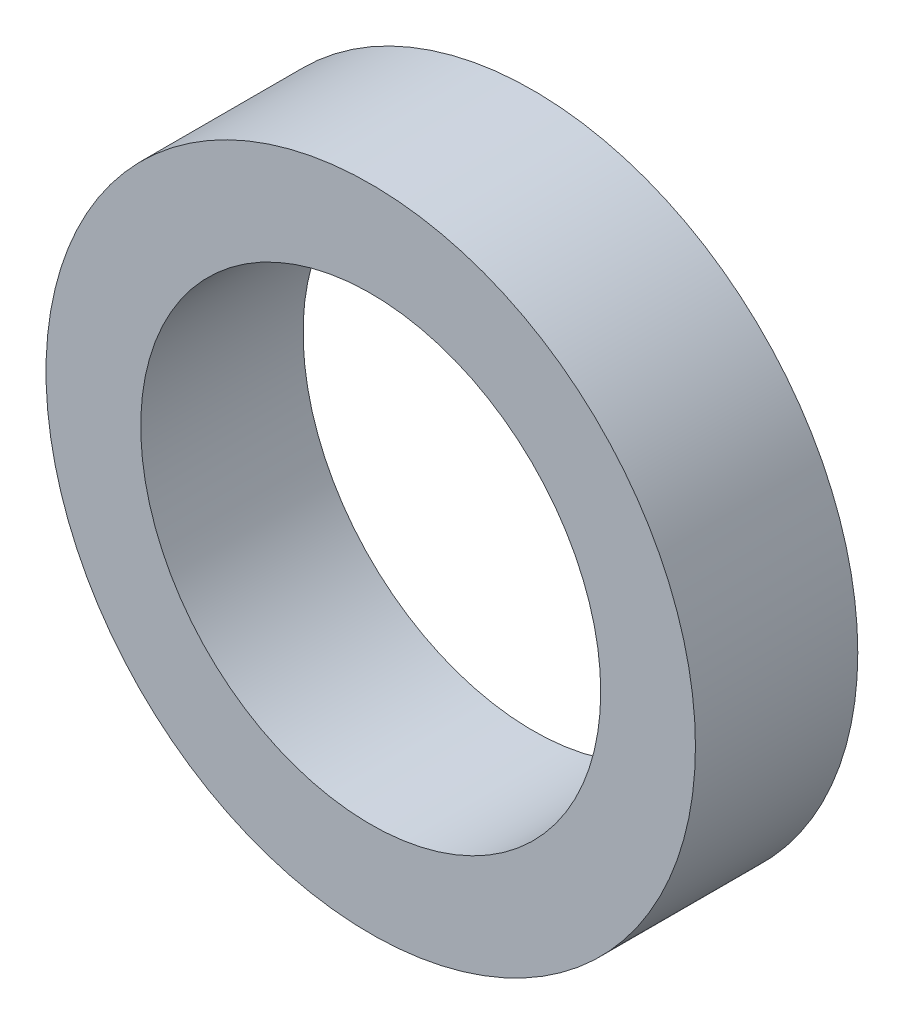
ISO-10303-21;
HEADER;
FILE_DESCRIPTION(('STEP AP214'),'2;1');
FILE_NAME('part.step','',(''),(''),'','','');
FILE_SCHEMA(('AUTOMOTIVE_DESIGN { 1 0 10303 214 1 1 1 1 }'));
ENDSEC;
DATA;
#1=APPLICATION_CONTEXT('core data for automotive mechanical design processes');
#2=APPLICATION_PROTOCOL_DEFINITION('international standard','automotive_design',2000,#1);
#3=PRODUCT_CONTEXT('',#1,'mechanical');
#4=PRODUCT('Part','Part','',(#3));
#5=PRODUCT_RELATED_PRODUCT_CATEGORY('part','',(#4));
#6=PRODUCT_DEFINITION_FORMATION('','',#4);
#7=PRODUCT_DEFINITION_CONTEXT('part definition',#1,'design');
#8=PRODUCT_DEFINITION('design','',#6,#7);
#9=PRODUCT_DEFINITION_SHAPE('','',#8);
#10=(LENGTH_UNIT() NAMED_UNIT(*) SI_UNIT(.MILLI.,.METRE.));
#11=(NAMED_UNIT(*) PLANE_ANGLE_UNIT() SI_UNIT($,.RADIAN.));
#12=(NAMED_UNIT(*) SI_UNIT($,.STERADIAN.) SOLID_ANGLE_UNIT());
#13=UNCERTAINTY_MEASURE_WITH_UNIT(LENGTH_MEASURE(1.E-05),#10,'distance_accuracy_value','');
#14=(GEOMETRIC_REPRESENTATION_CONTEXT(3) GLOBAL_UNCERTAINTY_ASSIGNED_CONTEXT((#13)) GLOBAL_UNIT_ASSIGNED_CONTEXT((#10,
#11,#12)) REPRESENTATION_CONTEXT('',''));
#15=CARTESIAN_POINT('',(0.,0.,0.));
#16=DIRECTION('',(0.,0.,1.));
#17=DIRECTION('',(1.,0.,0.));
#18=AXIS2_PLACEMENT_3D('',#15,#16,#17);
#19=CARTESIAN_POINT('',(0.,0.,3.));
#20=DIRECTION('',(0.,0.,1.));
#21=DIRECTION('',(1.,0.,0.));
#22=AXIS2_PLACEMENT_3D('',#19,#20,#21);
#23=PLANE('',#22);
#24=CARTESIAN_POINT('',(0.,0.,3.));
#25=DIRECTION('',(0.,0.,1.));
#26=DIRECTION('',(1.,0.,0.));
#27=AXIS2_PLACEMENT_3D('',#24,#25,#26);
#28=CIRCLE('',#27,6.);
#29=CARTESIAN_POINT('',(6.,0.,3.));
#30=VERTEX_POINT('',#29);
#31=EDGE_CURVE('E10',#30,#30,#28,.T.);
#32=ORIENTED_EDGE('',*,*,#31,.T.);
#33=EDGE_LOOP('',(#32));
#34=FACE_BOUND('',#33,.T.);
#35=CARTESIAN_POINT('',(0.,0.,3.));
#36=DIRECTION('',(0.,0.,1.));
#37=DIRECTION('',(1.,0.,0.));
#38=AXIS2_PLACEMENT_3D('',#35,#36,#37);
#39=CIRCLE('',#38,4.25);
#40=CARTESIAN_POINT('',(4.25,0.,3.));
#41=VERTEX_POINT('',#40);
#42=EDGE_CURVE('E42',#41,#41,#39,.T.);
#43=ORIENTED_EDGE('',*,*,#42,.F.);
#44=EDGE_LOOP('',(#43));
#45=FACE_BOUND('',#44,.T.);
#46=ADVANCED_FACE('F31',(#34,#45),#23,.T.);
#47=CARTESIAN_POINT('',(0.,0.,0.));
#48=DIRECTION('',(0.,0.,1.));
#49=DIRECTION('',(1.,0.,0.));
#50=AXIS2_PLACEMENT_3D('',#47,#48,#49);
#51=PLANE('',#50);
#52=CARTESIAN_POINT('',(0.,0.,0.));
#53=DIRECTION('',(0.,0.,1.));
#54=DIRECTION('',(1.,0.,0.));
#55=AXIS2_PLACEMENT_3D('',#52,#53,#54);
#56=CIRCLE('',#55,6.);
#57=CARTESIAN_POINT('',(6.,0.,0.));
#58=VERTEX_POINT('',#57);
#59=EDGE_CURVE('E35',#58,#58,#56,.T.);
#60=ORIENTED_EDGE('',*,*,#59,.F.);
#61=EDGE_LOOP('',(#60));
#62=FACE_BOUND('',#61,.T.);
#63=CARTESIAN_POINT('',(0.,0.,0.));
#64=DIRECTION('',(0.,0.,1.));
#65=DIRECTION('',(1.,0.,0.));
#66=AXIS2_PLACEMENT_3D('',#63,#64,#65);
#67=CIRCLE('',#66,4.25);
#68=CARTESIAN_POINT('',(4.25,0.,0.));
#69=VERTEX_POINT('',#68);
#70=EDGE_CURVE('E44',#69,#69,#67,.T.);
#71=ORIENTED_EDGE('',*,*,#70,.T.);
#72=EDGE_LOOP('',(#71));
#73=FACE_BOUND('',#72,.T.);
#74=ADVANCED_FACE('F54',(#62,#73),#51,.F.);
#75=CARTESIAN_POINT('',(0.,0.,3.));
#76=DIRECTION('',(0.,0.,-1.));
#77=DIRECTION('',(-1.,0.,0.));
#78=AXIS2_PLACEMENT_3D('',#75,#76,#77);
#79=CYLINDRICAL_SURFACE('',#78,6.);
#80=ORIENTED_EDGE('',*,*,#31,.F.);
#81=EDGE_LOOP('',(#80));
#82=FACE_BOUND('',#81,.T.);
#83=ORIENTED_EDGE('',*,*,#59,.T.);
#84=EDGE_LOOP('',(#83));
#85=FACE_BOUND('',#84,.T.);
#86=ADVANCED_FACE('F33',(#82,#85),#79,.T.);
#87=CARTESIAN_POINT('',(0.,0.,3.));
#88=DIRECTION('',(0.,0.,-1.));
#89=DIRECTION('',(-1.,0.,0.));
#90=AXIS2_PLACEMENT_3D('',#87,#88,#89);
#91=CYLINDRICAL_SURFACE('',#90,4.25);
#92=ORIENTED_EDGE('',*,*,#42,.T.);
#93=EDGE_LOOP('',(#92));
#94=FACE_BOUND('',#93,.T.);
#95=ORIENTED_EDGE('',*,*,#70,.F.);
#96=EDGE_LOOP('',(#95));
#97=FACE_BOUND('',#96,.T.);
#98=ADVANCED_FACE('F50',(#94,#97),#91,.F.);
#99=CLOSED_SHELL('',(#46,#74,#86,#98));
#100=MANIFOLD_SOLID_BREP('B2',#99);
#101=ADVANCED_BREP_SHAPE_REPRESENTATION('',(#18,#100),#14);
#102=SHAPE_DEFINITION_REPRESENTATION(#9,#101);
ENDSEC;
END-ISO-10303-21;
